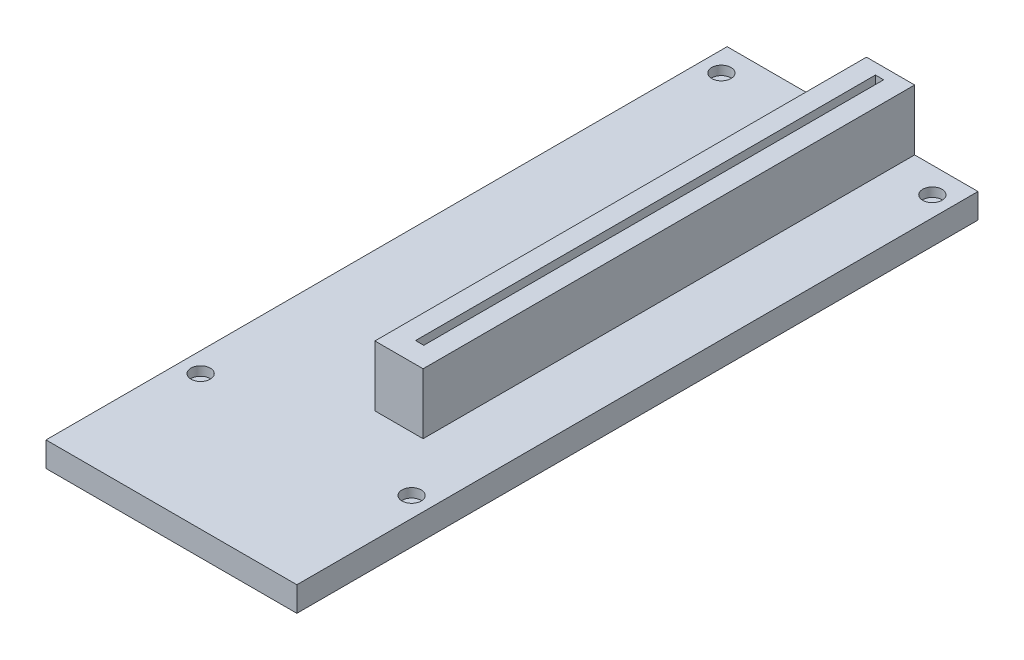
ISO-10303-21;
HEADER;
FILE_DESCRIPTION(('STEP AP214'),'2;1');
FILE_NAME('part.step','',(''),(''),'','','');
FILE_SCHEMA(('AUTOMOTIVE_DESIGN { 1 0 10303 214 1 1 1 1 }'));
ENDSEC;
DATA;
#1=APPLICATION_CONTEXT('core data for automotive mechanical design processes');
#2=APPLICATION_PROTOCOL_DEFINITION('international standard','automotive_design',2000,#1);
#3=PRODUCT_CONTEXT('',#1,'mechanical');
#4=PRODUCT('Part','Part','',(#3));
#5=PRODUCT_RELATED_PRODUCT_CATEGORY('part','',(#4));
#6=PRODUCT_DEFINITION_FORMATION('','',#4);
#7=PRODUCT_DEFINITION_CONTEXT('part definition',#1,'design');
#8=PRODUCT_DEFINITION('design','',#6,#7);
#9=PRODUCT_DEFINITION_SHAPE('','',#8);
#10=(LENGTH_UNIT() NAMED_UNIT(*) SI_UNIT(.MILLI.,.METRE.));
#11=(NAMED_UNIT(*) PLANE_ANGLE_UNIT() SI_UNIT($,.RADIAN.));
#12=(NAMED_UNIT(*) SI_UNIT($,.STERADIAN.) SOLID_ANGLE_UNIT());
#13=UNCERTAINTY_MEASURE_WITH_UNIT(LENGTH_MEASURE(1.E-05),#10,'distance_accuracy_value','');
#14=(GEOMETRIC_REPRESENTATION_CONTEXT(3) GLOBAL_UNCERTAINTY_ASSIGNED_CONTEXT((#13)) GLOBAL_UNIT_ASSIGNED_CONTEXT((#10,
#11,#12)) REPRESENTATION_CONTEXT('',''));
#15=CARTESIAN_POINT('',(0.,0.,0.));
#16=DIRECTION('',(0.,0.,1.));
#17=DIRECTION('',(1.,0.,0.));
#18=AXIS2_PLACEMENT_3D('',#15,#16,#17);
#19=CARTESIAN_POINT('',(0.,1.65,0.));
#20=DIRECTION('',(0.,-1.,0.));
#21=DIRECTION('',(0.,0.,-1.));
#22=AXIS2_PLACEMENT_3D('',#19,#20,#21);
#23=PLANE('',#22);
#24=CARTESIAN_POINT('',(19.1542935648354,1.65,-57.1710705256637));
#25=DIRECTION('',(0.,1.,0.));
#26=DIRECTION('',(0.,0.,-1.));
#27=AXIS2_PLACEMENT_3D('',#24,#25,#26);
#28=CIRCLE('',#27,1.75);
#29=CARTESIAN_POINT('',(19.1542935648354,1.65,-58.9210705256637));
#30=VERTEX_POINT('',#29);
#31=EDGE_CURVE('E232',#30,#30,#28,.T.);
#32=ORIENTED_EDGE('',*,*,#31,.F.);
#33=EDGE_LOOP('',(#32));
#34=FACE_BOUND('',#33,.T.);
#35=CARTESIAN_POINT('',(19.1542935648354,1.65,37.3795390441001));
#36=DIRECTION('',(0.,1.,0.));
#37=DIRECTION('',(0.,0.,-1.));
#38=AXIS2_PLACEMENT_3D('',#35,#36,#37);
#39=CIRCLE('',#38,1.75);
#40=CARTESIAN_POINT('',(19.1542935648354,1.65,35.6295390441001));
#41=VERTEX_POINT('',#40);
#42=EDGE_CURVE('E240',#41,#41,#39,.T.);
#43=ORIENTED_EDGE('',*,*,#42,.F.);
#44=EDGE_LOOP('',(#43));
#45=FACE_BOUND('',#44,.T.);
#46=CARTESIAN_POINT('',(-19.1542935648354,1.65,-57.1710705256637));
#47=DIRECTION('',(0.,1.,0.));
#48=DIRECTION('',(0.,0.,1.));
#49=AXIS2_PLACEMENT_3D('',#46,#47,#48);
#50=CIRCLE('',#49,1.75);
#51=CARTESIAN_POINT('',(-19.1542935648354,1.65,-55.4210705256637));
#52=VERTEX_POINT('',#51);
#53=EDGE_CURVE('E248',#52,#52,#50,.T.);
#54=ORIENTED_EDGE('',*,*,#53,.F.);
#55=EDGE_LOOP('',(#54));
#56=FACE_BOUND('',#55,.T.);
#57=CARTESIAN_POINT('',(-19.1542935648354,1.65,37.3795390441001));
#58=DIRECTION('',(0.,1.,0.));
#59=DIRECTION('',(0.,0.,1.));
#60=AXIS2_PLACEMENT_3D('',#57,#58,#59);
#61=CIRCLE('',#60,1.75);
#62=CARTESIAN_POINT('',(-19.1542935648354,1.65,39.1295390441001));
#63=VERTEX_POINT('',#62);
#64=EDGE_CURVE('E256',#63,#63,#61,.T.);
#65=ORIENTED_EDGE('',*,*,#64,.F.);
#66=EDGE_LOOP('',(#65));
#67=FACE_BOUND('',#66,.T.);
#68=DIRECTION('',(0.,0.,1.));
#69=VECTOR('',#68,1.);
#70=CARTESIAN_POINT('',(2.525,1.65,-61.835));
#71=LINE('',#70,#69);
#72=CARTESIAN_POINT('',(2.525,1.65,-61.835));
#73=VERTEX_POINT('',#72);
#74=CARTESIAN_POINT('',(2.52500000000001,1.65,27.415));
#75=VERTEX_POINT('',#74);
#76=EDGE_CURVE('E184',#73,#75,#71,.T.);
#77=ORIENTED_EDGE('',*,*,#76,.F.);
#78=DIRECTION('',(-1.,0.,0.));
#79=VECTOR('',#78,1.);
#80=CARTESIAN_POINT('',(-22.775,1.65,-61.835));
#81=LINE('',#80,#79);
#82=CARTESIAN_POINT('',(-22.775,1.65,-61.835));
#83=VERTEX_POINT('',#82);
#84=EDGE_CURVE('E267',#73,#83,#81,.T.);
#85=ORIENTED_EDGE('',*,*,#84,.T.);
#86=DIRECTION('',(0.,0.,1.));
#87=VECTOR('',#86,1.);
#88=CARTESIAN_POINT('',(-22.775,1.65,61.835));
#89=LINE('',#88,#87);
#90=CARTESIAN_POINT('',(-22.775,1.65,61.835));
#91=VERTEX_POINT('',#90);
#92=EDGE_CURVE('E272',#83,#91,#89,.T.);
#93=ORIENTED_EDGE('',*,*,#92,.T.);
#94=DIRECTION('',(1.,0.,0.));
#95=VECTOR('',#94,1.);
#96=CARTESIAN_POINT('',(-22.775,1.65,61.835));
#97=LINE('',#96,#95);
#98=CARTESIAN_POINT('',(22.775,1.65,61.835));
#99=VERTEX_POINT('',#98);
#100=EDGE_CURVE('E275',#91,#99,#97,.T.);
#101=ORIENTED_EDGE('',*,*,#100,.T.);
#102=DIRECTION('',(0.,0.,-1.));
#103=VECTOR('',#102,1.);
#104=CARTESIAN_POINT('',(22.775,1.65,61.835));
#105=LINE('',#104,#103);
#106=CARTESIAN_POINT('',(22.775,1.65,-61.835));
#107=VERTEX_POINT('',#106);
#108=EDGE_CURVE('E260',#99,#107,#105,.T.);
#109=ORIENTED_EDGE('',*,*,#108,.T.);
#110=CARTESIAN_POINT('',(11.275,1.65,-61.835));
#111=VERTEX_POINT('',#110);
#112=EDGE_CURVE('E268',#107,#111,#81,.T.);
#113=ORIENTED_EDGE('',*,*,#112,.T.);
#114=DIRECTION('',(0.,0.,1.));
#115=VECTOR('',#114,1.);
#116=CARTESIAN_POINT('',(11.275,1.65,-61.835));
#117=LINE('',#116,#115);
#118=CARTESIAN_POINT('',(11.275,1.65,27.415));
#119=VERTEX_POINT('',#118);
#120=EDGE_CURVE('E198',#111,#119,#117,.T.);
#121=ORIENTED_EDGE('',*,*,#120,.T.);
#122=DIRECTION('',(1.,0.,0.));
#123=VECTOR('',#122,1.);
#124=CARTESIAN_POINT('',(2.52500000000001,1.65,27.415));
#125=LINE('',#124,#123);
#126=EDGE_CURVE('E63',#75,#119,#125,.T.);
#127=ORIENTED_EDGE('',*,*,#126,.F.);
#128=EDGE_LOOP('',(#77,#85,#93,#101,#109,#113,#121,#127));
#129=FACE_BOUND('',#128,.T.);
#130=ADVANCED_FACE('F39',(#34,#45,#56,#67,#129),#23,.F.);
#131=CARTESIAN_POINT('',(22.775,1.65,61.835));
#132=DIRECTION('',(-1.,0.,0.));
#133=DIRECTION('',(0.,0.,1.));
#134=AXIS2_PLACEMENT_3D('',#131,#132,#133);
#135=PLANE('',#134);
#136=DIRECTION('',(0.,-1.,0.));
#137=VECTOR('',#136,1.);
#138=CARTESIAN_POINT('',(22.775,1.65,61.835));
#139=LINE('',#138,#137);
#140=CARTESIAN_POINT('',(22.775,-2.85,61.835));
#141=VERTEX_POINT('',#140);
#142=EDGE_CURVE('E278',#99,#141,#139,.T.);
#143=ORIENTED_EDGE('',*,*,#142,.T.);
#144=DIRECTION('',(0.,0.,1.));
#145=VECTOR('',#144,1.);
#146=CARTESIAN_POINT('',(22.775,-2.85,-61.835));
#147=LINE('',#146,#145);
#148=CARTESIAN_POINT('',(22.775,-2.85,-61.835));
#149=VERTEX_POINT('',#148);
#150=EDGE_CURVE('E219',#149,#141,#147,.T.);
#151=ORIENTED_EDGE('',*,*,#150,.F.);
#152=DIRECTION('',(0.,-1.,0.));
#153=VECTOR('',#152,1.);
#154=CARTESIAN_POINT('',(22.775,1.65,-61.835));
#155=LINE('',#154,#153);
#156=EDGE_CURVE('E11',#107,#149,#155,.T.);
#157=ORIENTED_EDGE('',*,*,#156,.F.);
#158=ORIENTED_EDGE('',*,*,#108,.F.);
#159=EDGE_LOOP('',(#143,#151,#157,#158));
#160=FACE_BOUND('',#159,.T.);
#161=ADVANCED_FACE('F41',(#160),#135,.F.);
#162=CARTESIAN_POINT('',(-22.775,1.65,-61.835));
#163=DIRECTION('',(0.,0.,1.));
#164=DIRECTION('',(1.,0.,0.));
#165=AXIS2_PLACEMENT_3D('',#162,#163,#164);
#166=PLANE('',#165);
#167=ORIENTED_EDGE('',*,*,#156,.T.);
#168=DIRECTION('',(1.,0.,0.));
#169=VECTOR('',#168,1.);
#170=CARTESIAN_POINT('',(-22.775,-2.85,-61.835));
#171=LINE('',#170,#169);
#172=CARTESIAN_POINT('',(-22.775,-2.85,-61.835));
#173=VERTEX_POINT('',#172);
#174=EDGE_CURVE('E215',#173,#149,#171,.T.);
#175=ORIENTED_EDGE('',*,*,#174,.F.);
#176=DIRECTION('',(0.,-1.,0.));
#177=VECTOR('',#176,1.);
#178=CARTESIAN_POINT('',(-22.775,1.65,-61.835));
#179=LINE('',#178,#177);
#180=EDGE_CURVE('E48',#83,#173,#179,.T.);
#181=ORIENTED_EDGE('',*,*,#180,.F.);
#182=ORIENTED_EDGE('',*,*,#84,.F.);
#183=DIRECTION('',(0.,-1.,0.));
#184=VECTOR('',#183,1.);
#185=CARTESIAN_POINT('',(2.525,12.65,-61.835));
#186=LINE('',#185,#184);
#187=CARTESIAN_POINT('',(2.525,12.65,-61.835));
#188=VERTEX_POINT('',#187);
#189=EDGE_CURVE('E206',#188,#73,#186,.T.);
#190=ORIENTED_EDGE('',*,*,#189,.F.);
#191=DIRECTION('',(1.,0.,0.));
#192=VECTOR('',#191,1.);
#193=CARTESIAN_POINT('',(2.525,12.65,-61.835));
#194=LINE('',#193,#192);
#195=CARTESIAN_POINT('',(11.275,12.65,-61.835));
#196=VERTEX_POINT('',#195);
#197=EDGE_CURVE('E188',#188,#196,#194,.T.);
#198=ORIENTED_EDGE('',*,*,#197,.T.);
#199=DIRECTION('',(0.,-1.,0.));
#200=VECTOR('',#199,1.);
#201=CARTESIAN_POINT('',(11.275,12.65,-61.835));
#202=LINE('',#201,#200);
#203=EDGE_CURVE('E209',#196,#111,#202,.T.);
#204=ORIENTED_EDGE('',*,*,#203,.T.);
#205=ORIENTED_EDGE('',*,*,#112,.F.);
#206=EDGE_LOOP('',(#167,#175,#181,#182,#190,#198,#204,#205));
#207=FACE_BOUND('',#206,.T.);
#208=ADVANCED_FACE('F296',(#207),#166,.F.);
#209=CARTESIAN_POINT('',(-22.775,1.65,61.835));
#210=DIRECTION('',(1.,0.,0.));
#211=DIRECTION('',(0.,0.,-1.));
#212=AXIS2_PLACEMENT_3D('',#209,#210,#211);
#213=PLANE('',#212);
#214=ORIENTED_EDGE('',*,*,#180,.T.);
#215=DIRECTION('',(0.,0.,-1.));
#216=VECTOR('',#215,1.);
#217=CARTESIAN_POINT('',(-22.775,-2.85,61.835));
#218=LINE('',#217,#216);
#219=CARTESIAN_POINT('',(-22.775,-2.85,61.835));
#220=VERTEX_POINT('',#219);
#221=EDGE_CURVE('E227',#220,#173,#218,.T.);
#222=ORIENTED_EDGE('',*,*,#221,.F.);
#223=DIRECTION('',(0.,-1.,0.));
#224=VECTOR('',#223,1.);
#225=CARTESIAN_POINT('',(-22.775,1.65,61.835));
#226=LINE('',#225,#224);
#227=EDGE_CURVE('E281',#91,#220,#226,.T.);
#228=ORIENTED_EDGE('',*,*,#227,.F.);
#229=ORIENTED_EDGE('',*,*,#92,.F.);
#230=EDGE_LOOP('',(#214,#222,#228,#229));
#231=FACE_BOUND('',#230,.T.);
#232=ADVANCED_FACE('F288',(#231),#213,.F.);
#233=CARTESIAN_POINT('',(-22.775,1.65,61.835));
#234=DIRECTION('',(0.,0.,-1.));
#235=DIRECTION('',(-1.,0.,0.));
#236=AXIS2_PLACEMENT_3D('',#233,#234,#235);
#237=PLANE('',#236);
#238=ORIENTED_EDGE('',*,*,#227,.T.);
#239=DIRECTION('',(-1.,0.,0.));
#240=VECTOR('',#239,1.);
#241=CARTESIAN_POINT('',(22.775,-2.85,61.835));
#242=LINE('',#241,#240);
#243=EDGE_CURVE('E223',#141,#220,#242,.T.);
#244=ORIENTED_EDGE('',*,*,#243,.F.);
#245=ORIENTED_EDGE('',*,*,#142,.F.);
#246=ORIENTED_EDGE('',*,*,#100,.F.);
#247=EDGE_LOOP('',(#238,#244,#245,#246));
#248=FACE_BOUND('',#247,.T.);
#249=ADVANCED_FACE('F303',(#248),#237,.F.);
#250=CARTESIAN_POINT('',(-19.1542935648354,1.65,37.3795390441001));
#251=DIRECTION('',(0.,-1.,0.));
#252=DIRECTION('',(0.,0.,-1.));
#253=AXIS2_PLACEMENT_3D('',#250,#251,#252);
#254=CYLINDRICAL_SURFACE('',#253,1.75);
#255=ORIENTED_EDGE('',*,*,#64,.T.);
#256=EDGE_LOOP('',(#255));
#257=FACE_BOUND('',#256,.T.);
#258=CARTESIAN_POINT('',(-19.1542935648354,0.,37.3795390441001));
#259=DIRECTION('',(0.,1.,0.));
#260=DIRECTION('',(0.,0.,1.));
#261=AXIS2_PLACEMENT_3D('',#258,#259,#260);
#262=CIRCLE('',#261,1.75);
#263=CARTESIAN_POINT('',(-19.1542935648354,0.,39.1295390441001));
#264=VERTEX_POINT('',#263);
#265=EDGE_CURVE('E252',#264,#264,#262,.T.);
#266=ORIENTED_EDGE('',*,*,#265,.F.);
#267=EDGE_LOOP('',(#266));
#268=FACE_BOUND('',#267,.T.);
#269=ADVANCED_FACE('F340',(#257,#268),#254,.F.);
#270=CARTESIAN_POINT('',(-19.1542935648354,1.65,-57.1710705256637));
#271=DIRECTION('',(0.,-1.,0.));
#272=DIRECTION('',(0.,0.,-1.));
#273=AXIS2_PLACEMENT_3D('',#270,#271,#272);
#274=CYLINDRICAL_SURFACE('',#273,1.75);
#275=ORIENTED_EDGE('',*,*,#53,.T.);
#276=EDGE_LOOP('',(#275));
#277=FACE_BOUND('',#276,.T.);
#278=CARTESIAN_POINT('',(-19.1542935648354,0.,-57.1710705256637));
#279=DIRECTION('',(0.,1.,0.));
#280=DIRECTION('',(0.,0.,1.));
#281=AXIS2_PLACEMENT_3D('',#278,#279,#280);
#282=CIRCLE('',#281,1.75);
#283=CARTESIAN_POINT('',(-19.1542935648354,0.,-55.4210705256637));
#284=VERTEX_POINT('',#283);
#285=EDGE_CURVE('E244',#284,#284,#282,.T.);
#286=ORIENTED_EDGE('',*,*,#285,.F.);
#287=EDGE_LOOP('',(#286));
#288=FACE_BOUND('',#287,.T.);
#289=ADVANCED_FACE('F365',(#277,#288),#274,.F.);
#290=CARTESIAN_POINT('',(19.1542935648354,1.65,37.3795390441001));
#291=DIRECTION('',(0.,-1.,0.));
#292=DIRECTION('',(0.,0.,-1.));
#293=AXIS2_PLACEMENT_3D('',#290,#291,#292);
#294=CYLINDRICAL_SURFACE('',#293,1.75);
#295=ORIENTED_EDGE('',*,*,#42,.T.);
#296=EDGE_LOOP('',(#295));
#297=FACE_BOUND('',#296,.T.);
#298=CARTESIAN_POINT('',(19.1542935648354,0.,37.3795390441001));
#299=DIRECTION('',(0.,1.,0.));
#300=DIRECTION('',(0.,0.,-1.));
#301=AXIS2_PLACEMENT_3D('',#298,#299,#300);
#302=CIRCLE('',#301,1.75);
#303=CARTESIAN_POINT('',(19.1542935648354,0.,35.6295390441001));
#304=VERTEX_POINT('',#303);
#305=EDGE_CURVE('E236',#304,#304,#302,.T.);
#306=ORIENTED_EDGE('',*,*,#305,.F.);
#307=EDGE_LOOP('',(#306));
#308=FACE_BOUND('',#307,.T.);
#309=ADVANCED_FACE('F372',(#297,#308),#294,.F.);
#310=CARTESIAN_POINT('',(19.1542935648354,1.65,-57.1710705256637));
#311=DIRECTION('',(0.,-1.,0.));
#312=DIRECTION('',(0.,0.,-1.));
#313=AXIS2_PLACEMENT_3D('',#310,#311,#312);
#314=CYLINDRICAL_SURFACE('',#313,1.75);
#315=ORIENTED_EDGE('',*,*,#31,.T.);
#316=EDGE_LOOP('',(#315));
#317=FACE_BOUND('',#316,.T.);
#318=CARTESIAN_POINT('',(19.1542935648354,0.,-57.1710705256637));
#319=DIRECTION('',(0.,1.,0.));
#320=DIRECTION('',(0.,0.,-1.));
#321=AXIS2_PLACEMENT_3D('',#318,#319,#320);
#322=CIRCLE('',#321,1.75);
#323=CARTESIAN_POINT('',(19.1542935648354,0.,-58.9210705256637));
#324=VERTEX_POINT('',#323);
#325=EDGE_CURVE('E231',#324,#324,#322,.T.);
#326=ORIENTED_EDGE('',*,*,#325,.F.);
#327=EDGE_LOOP('',(#326));
#328=FACE_BOUND('',#327,.T.);
#329=ADVANCED_FACE('F379',(#317,#328),#314,.F.);
#330=CARTESIAN_POINT('',(0.,0.,0.));
#331=DIRECTION('',(0.,-1.,0.));
#332=DIRECTION('',(0.,0.,-1.));
#333=AXIS2_PLACEMENT_3D('',#330,#331,#332);
#334=PLANE('',#333);
#335=ORIENTED_EDGE('',*,*,#325,.T.);
#336=EDGE_LOOP('',(#335));
#337=FACE_BOUND('',#336,.T.);
#338=ADVANCED_FACE('F387',(#337),#334,.F.);
#339=ORIENTED_EDGE('',*,*,#285,.T.);
#340=EDGE_LOOP('',(#339));
#341=FACE_BOUND('',#340,.T.);
#342=ADVANCED_FACE('F394',(#341),#334,.F.);
#343=ORIENTED_EDGE('',*,*,#265,.T.);
#344=EDGE_LOOP('',(#343));
#345=FACE_BOUND('',#344,.T.);
#346=ADVANCED_FACE('F402',(#345),#334,.F.);
#347=ORIENTED_EDGE('',*,*,#305,.T.);
#348=EDGE_LOOP('',(#347));
#349=FACE_BOUND('',#348,.T.);
#350=ADVANCED_FACE('F328',(#349),#334,.F.);
#351=CARTESIAN_POINT('',(0.,-2.85,0.));
#352=DIRECTION('',(0.,-1.,0.));
#353=DIRECTION('',(0.,0.,-1.));
#354=AXIS2_PLACEMENT_3D('',#351,#352,#353);
#355=PLANE('',#354);
#356=ORIENTED_EDGE('',*,*,#174,.T.);
#357=ORIENTED_EDGE('',*,*,#150,.T.);
#358=ORIENTED_EDGE('',*,*,#243,.T.);
#359=ORIENTED_EDGE('',*,*,#221,.T.);
#360=EDGE_LOOP('',(#356,#357,#358,#359));
#361=FACE_BOUND('',#360,.T.);
#362=ADVANCED_FACE('F294',(#361),#355,.T.);
#363=CARTESIAN_POINT('',(2.52500000000001,12.65,27.415));
#364=DIRECTION('',(0.,0.,-1.));
#365=DIRECTION('',(-1.,0.,0.));
#366=AXIS2_PLACEMENT_3D('',#363,#364,#365);
#367=PLANE('',#366);
#368=ORIENTED_EDGE('',*,*,#126,.T.);
#369=DIRECTION('',(0.,-1.,0.));
#370=VECTOR('',#369,1.);
#371=CARTESIAN_POINT('',(11.275,12.65,27.415));
#372=LINE('',#371,#370);
#373=CARTESIAN_POINT('',(11.275,12.65,27.415));
#374=VERTEX_POINT('',#373);
#375=EDGE_CURVE('E212',#374,#119,#372,.T.);
#376=ORIENTED_EDGE('',*,*,#375,.F.);
#377=DIRECTION('',(1.,0.,0.));
#378=VECTOR('',#377,1.);
#379=CARTESIAN_POINT('',(2.52500000000001,12.65,27.415));
#380=LINE('',#379,#378);
#381=CARTESIAN_POINT('',(2.52500000000001,12.65,27.415));
#382=VERTEX_POINT('',#381);
#383=EDGE_CURVE('E180',#382,#374,#380,.T.);
#384=ORIENTED_EDGE('',*,*,#383,.F.);
#385=DIRECTION('',(0.,-1.,0.));
#386=VECTOR('',#385,1.);
#387=CARTESIAN_POINT('',(2.52500000000001,12.65,27.415));
#388=LINE('',#387,#386);
#389=EDGE_CURVE('E195',#382,#75,#388,.T.);
#390=ORIENTED_EDGE('',*,*,#389,.T.);
#391=EDGE_LOOP('',(#368,#376,#384,#390));
#392=FACE_BOUND('',#391,.T.);
#393=ADVANCED_FACE('F320',(#392),#367,.F.);
#394=CARTESIAN_POINT('',(11.275,12.65,-61.835));
#395=DIRECTION('',(1.,0.,0.));
#396=DIRECTION('',(0.,0.,-1.));
#397=AXIS2_PLACEMENT_3D('',#394,#395,#396);
#398=PLANE('',#397);
#399=ORIENTED_EDGE('',*,*,#120,.F.);
#400=ORIENTED_EDGE('',*,*,#203,.F.);
#401=DIRECTION('',(0.,0.,1.));
#402=VECTOR('',#401,1.);
#403=CARTESIAN_POINT('',(11.275,12.65,-61.835));
#404=LINE('',#403,#402);
#405=EDGE_CURVE('E183',#196,#374,#404,.T.);
#406=ORIENTED_EDGE('',*,*,#405,.T.);
#407=ORIENTED_EDGE('',*,*,#375,.T.);
#408=EDGE_LOOP('',(#399,#400,#406,#407));
#409=FACE_BOUND('',#408,.T.);
#410=ADVANCED_FACE('F319',(#409),#398,.T.);
#411=CARTESIAN_POINT('',(2.525,12.65,-61.835));
#412=DIRECTION('',(1.,0.,0.));
#413=DIRECTION('',(0.,0.,-1.));
#414=AXIS2_PLACEMENT_3D('',#411,#412,#413);
#415=PLANE('',#414);
#416=ORIENTED_EDGE('',*,*,#76,.T.);
#417=ORIENTED_EDGE('',*,*,#389,.F.);
#418=DIRECTION('',(0.,0.,1.));
#419=VECTOR('',#418,1.);
#420=CARTESIAN_POINT('',(2.525,12.65,-61.835));
#421=LINE('',#420,#419);
#422=EDGE_CURVE('E192',#188,#382,#421,.T.);
#423=ORIENTED_EDGE('',*,*,#422,.F.);
#424=ORIENTED_EDGE('',*,*,#189,.T.);
#425=EDGE_LOOP('',(#416,#417,#423,#424));
#426=FACE_BOUND('',#425,.T.);
#427=ADVANCED_FACE('F312',(#426),#415,.F.);
#428=CARTESIAN_POINT('',(0.,12.65,0.));
#429=DIRECTION('',(0.,-1.,0.));
#430=DIRECTION('',(0.,0.,-1.));
#431=AXIS2_PLACEMENT_3D('',#428,#429,#430);
#432=PLANE('',#431);
#433=DIRECTION('',(1.,0.,0.));
#434=VECTOR('',#433,1.);
#435=CARTESIAN_POINT('',(6.15000000000001,12.65,23.665));
#436=LINE('',#435,#434);
#437=CARTESIAN_POINT('',(6.15000000000001,12.65,23.665));
#438=VERTEX_POINT('',#437);
#439=CARTESIAN_POINT('',(7.65000000000001,12.65,23.665));
#440=VERTEX_POINT('',#439);
#441=EDGE_CURVE('E166',#438,#440,#436,.T.);
#442=ORIENTED_EDGE('',*,*,#441,.F.);
#443=DIRECTION('',(0.,0.,1.));
#444=VECTOR('',#443,1.);
#445=CARTESIAN_POINT('',(6.15,12.65,-59.835));
#446=LINE('',#445,#444);
#447=CARTESIAN_POINT('',(6.15,12.65,-59.835));
#448=VERTEX_POINT('',#447);
#449=EDGE_CURVE('E55',#448,#438,#446,.T.);
#450=ORIENTED_EDGE('',*,*,#449,.F.);
#451=DIRECTION('',(-1.,0.,0.));
#452=VECTOR('',#451,1.);
#453=CARTESIAN_POINT('',(6.15,12.65,-59.835));
#454=LINE('',#453,#452);
#455=CARTESIAN_POINT('',(7.65,12.65,-59.835));
#456=VERTEX_POINT('',#455);
#457=EDGE_CURVE('E153',#456,#448,#454,.T.);
#458=ORIENTED_EDGE('',*,*,#457,.F.);
#459=DIRECTION('',(0.,0.,-1.));
#460=VECTOR('',#459,1.);
#461=CARTESIAN_POINT('',(7.65,12.65,-59.835));
#462=LINE('',#461,#460);
#463=EDGE_CURVE('E157',#440,#456,#462,.T.);
#464=ORIENTED_EDGE('',*,*,#463,.F.);
#465=EDGE_LOOP('',(#442,#450,#458,#464));
#466=FACE_BOUND('',#465,.T.);
#467=ORIENTED_EDGE('',*,*,#383,.T.);
#468=ORIENTED_EDGE('',*,*,#405,.F.);
#469=ORIENTED_EDGE('',*,*,#197,.F.);
#470=ORIENTED_EDGE('',*,*,#422,.T.);
#471=EDGE_LOOP('',(#467,#468,#469,#470));
#472=FACE_BOUND('',#471,.T.);
#473=ADVANCED_FACE('F316',(#466,#472),#432,.F.);
#474=CARTESIAN_POINT('',(6.15,5.65,-59.835));
#475=DIRECTION('',(-1.,0.,0.));
#476=DIRECTION('',(0.,0.,1.));
#477=AXIS2_PLACEMENT_3D('',#474,#475,#476);
#478=PLANE('',#477);
#479=ORIENTED_EDGE('',*,*,#449,.T.);
#480=DIRECTION('',(0.,1.,0.));
#481=VECTOR('',#480,1.);
#482=CARTESIAN_POINT('',(6.15000000000001,5.65,23.665));
#483=LINE('',#482,#481);
#484=CARTESIAN_POINT('',(6.15000000000001,5.65,23.665));
#485=VERTEX_POINT('',#484);
#486=EDGE_CURVE('E128',#485,#438,#483,.T.);
#487=ORIENTED_EDGE('',*,*,#486,.F.);
#488=DIRECTION('',(0.,0.,1.));
#489=VECTOR('',#488,1.);
#490=CARTESIAN_POINT('',(6.15,5.65,-59.835));
#491=LINE('',#490,#489);
#492=CARTESIAN_POINT('',(6.15,5.65,-59.835));
#493=VERTEX_POINT('',#492);
#494=EDGE_CURVE('E132',#493,#485,#491,.T.);
#495=ORIENTED_EDGE('',*,*,#494,.F.);
#496=DIRECTION('',(0.,1.,0.));
#497=VECTOR('',#496,1.);
#498=CARTESIAN_POINT('',(6.15,5.65,-59.835));
#499=LINE('',#498,#497);
#500=EDGE_CURVE('E172',#493,#448,#499,.T.);
#501=ORIENTED_EDGE('',*,*,#500,.T.);
#502=EDGE_LOOP('',(#479,#487,#495,#501));
#503=FACE_BOUND('',#502,.T.);
#504=ADVANCED_FACE('F130',(#503),#478,.F.);
#505=CARTESIAN_POINT('',(6.15,5.65,-59.835));
#506=DIRECTION('',(0.,0.,-1.));
#507=DIRECTION('',(-1.,0.,0.));
#508=AXIS2_PLACEMENT_3D('',#505,#506,#507);
#509=PLANE('',#508);
#510=ORIENTED_EDGE('',*,*,#457,.T.);
#511=ORIENTED_EDGE('',*,*,#500,.F.);
#512=DIRECTION('',(-1.,0.,0.));
#513=VECTOR('',#512,1.);
#514=CARTESIAN_POINT('',(6.15,5.65,-59.835));
#515=LINE('',#514,#513);
#516=CARTESIAN_POINT('',(7.65,5.65,-59.835));
#517=VERTEX_POINT('',#516);
#518=EDGE_CURVE('E139',#517,#493,#515,.T.);
#519=ORIENTED_EDGE('',*,*,#518,.F.);
#520=DIRECTION('',(0.,1.,0.));
#521=VECTOR('',#520,1.);
#522=CARTESIAN_POINT('',(7.65,5.65,-59.835));
#523=LINE('',#522,#521);
#524=EDGE_CURVE('E175',#517,#456,#523,.T.);
#525=ORIENTED_EDGE('',*,*,#524,.T.);
#526=EDGE_LOOP('',(#510,#511,#519,#525));
#527=FACE_BOUND('',#526,.T.);
#528=ADVANCED_FACE('F464',(#527),#509,.F.);
#529=CARTESIAN_POINT('',(7.65,5.65,-59.835));
#530=DIRECTION('',(1.,0.,0.));
#531=DIRECTION('',(0.,0.,-1.));
#532=AXIS2_PLACEMENT_3D('',#529,#530,#531);
#533=PLANE('',#532);
#534=ORIENTED_EDGE('',*,*,#463,.T.);
#535=ORIENTED_EDGE('',*,*,#524,.F.);
#536=DIRECTION('',(0.,0.,-1.));
#537=VECTOR('',#536,1.);
#538=CARTESIAN_POINT('',(7.65,5.65,-59.835));
#539=LINE('',#538,#537);
#540=CARTESIAN_POINT('',(7.65000000000001,5.65,23.665));
#541=VERTEX_POINT('',#540);
#542=EDGE_CURVE('E148',#541,#517,#539,.T.);
#543=ORIENTED_EDGE('',*,*,#542,.F.);
#544=DIRECTION('',(0.,1.,0.));
#545=VECTOR('',#544,1.);
#546=CARTESIAN_POINT('',(7.65000000000001,5.65,23.665));
#547=LINE('',#546,#545);
#548=EDGE_CURVE('E138',#541,#440,#547,.T.);
#549=ORIENTED_EDGE('',*,*,#548,.T.);
#550=EDGE_LOOP('',(#534,#535,#543,#549));
#551=FACE_BOUND('',#550,.T.);
#552=ADVANCED_FACE('F472',(#551),#533,.F.);
#553=CARTESIAN_POINT('',(6.15000000000001,5.65,23.665));
#554=DIRECTION('',(0.,0.,1.));
#555=DIRECTION('',(1.,0.,0.));
#556=AXIS2_PLACEMENT_3D('',#553,#554,#555);
#557=PLANE('',#556);
#558=ORIENTED_EDGE('',*,*,#441,.T.);
#559=ORIENTED_EDGE('',*,*,#548,.F.);
#560=DIRECTION('',(1.,0.,0.));
#561=VECTOR('',#560,1.);
#562=CARTESIAN_POINT('',(6.15000000000001,5.65,23.665));
#563=LINE('',#562,#561);
#564=EDGE_CURVE('E142',#485,#541,#563,.T.);
#565=ORIENTED_EDGE('',*,*,#564,.F.);
#566=ORIENTED_EDGE('',*,*,#486,.T.);
#567=EDGE_LOOP('',(#558,#559,#565,#566));
#568=FACE_BOUND('',#567,.T.);
#569=ADVANCED_FACE('F143',(#568),#557,.F.);
#570=CARTESIAN_POINT('',(0.,5.65,0.));
#571=DIRECTION('',(0.,1.,0.));
#572=DIRECTION('',(0.,0.,1.));
#573=AXIS2_PLACEMENT_3D('',#570,#571,#572);
#574=PLANE('',#573);
#575=ORIENTED_EDGE('',*,*,#494,.T.);
#576=ORIENTED_EDGE('',*,*,#564,.T.);
#577=ORIENTED_EDGE('',*,*,#542,.T.);
#578=ORIENTED_EDGE('',*,*,#518,.T.);
#579=EDGE_LOOP('',(#575,#576,#577,#578));
#580=FACE_BOUND('',#579,.T.);
#581=ADVANCED_FACE('F150',(#580),#574,.T.);
#582=CLOSED_SHELL('',(#130,#161,#208,#232,#249,#269,#289,#309,#329,#338,#342,#346,#350,#362,
#393,#410,#427,#473,#504,#528,#552,#569,#581));
#583=MANIFOLD_SOLID_BREP('B2',#582);
#584=ADVANCED_BREP_SHAPE_REPRESENTATION('',(#18,#583),#14);
#585=SHAPE_DEFINITION_REPRESENTATION(#9,#584);
ENDSEC;
END-ISO-10303-21;
